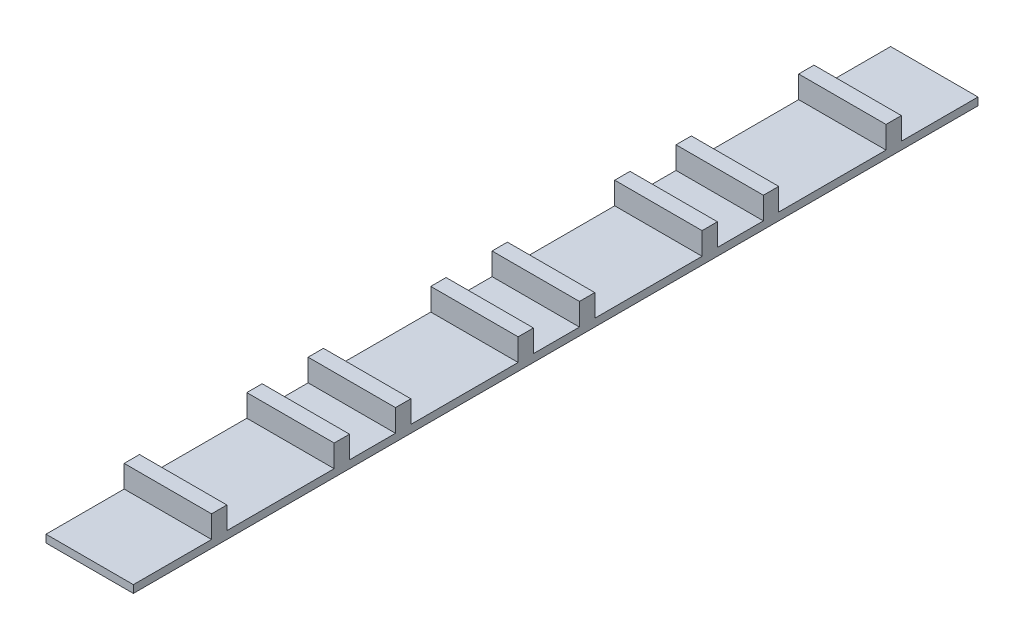
ISO-10303-21;
HEADER;
FILE_DESCRIPTION(('STEP AP214'),'2;1');
FILE_NAME('part.step','',(''),(''),'','','');
FILE_SCHEMA(('AUTOMOTIVE_DESIGN { 1 0 10303 214 1 1 1 1 }'));
ENDSEC;
DATA;
#1=APPLICATION_CONTEXT('core data for automotive mechanical design processes');
#2=APPLICATION_PROTOCOL_DEFINITION('international standard','automotive_design',2000,#1);
#3=PRODUCT_CONTEXT('',#1,'mechanical');
#4=PRODUCT('Part','Part','',(#3));
#5=PRODUCT_RELATED_PRODUCT_CATEGORY('part','',(#4));
#6=PRODUCT_DEFINITION_FORMATION('','',#4);
#7=PRODUCT_DEFINITION_CONTEXT('part definition',#1,'design');
#8=PRODUCT_DEFINITION('design','',#6,#7);
#9=PRODUCT_DEFINITION_SHAPE('','',#8);
#10=(LENGTH_UNIT() NAMED_UNIT(*) SI_UNIT(.MILLI.,.METRE.));
#11=(NAMED_UNIT(*) PLANE_ANGLE_UNIT() SI_UNIT($,.RADIAN.));
#12=(NAMED_UNIT(*) SI_UNIT($,.STERADIAN.) SOLID_ANGLE_UNIT());
#13=UNCERTAINTY_MEASURE_WITH_UNIT(LENGTH_MEASURE(1.E-05),#10,'distance_accuracy_value','');
#14=(GEOMETRIC_REPRESENTATION_CONTEXT(3) GLOBAL_UNCERTAINTY_ASSIGNED_CONTEXT((#13)) GLOBAL_UNIT_ASSIGNED_CONTEXT((#10,
#11,#12)) REPRESENTATION_CONTEXT('',''));
#15=CARTESIAN_POINT('',(0.,0.,0.));
#16=DIRECTION('',(0.,0.,1.));
#17=DIRECTION('',(1.,0.,0.));
#18=AXIS2_PLACEMENT_3D('',#15,#16,#17);
#19=CARTESIAN_POINT('',(0.,1.27,139.954));
#20=DIRECTION('',(0.,-1.,0.));
#21=DIRECTION('',(0.,0.,-1.));
#22=AXIS2_PLACEMENT_3D('',#19,#20,#21);
#23=PLANE('',#22);
#24=DIRECTION('',(1.,0.,0.));
#25=VECTOR('',#24,1.);
#26=CARTESIAN_POINT('',(0.,1.27,127.));
#27=LINE('',#26,#25);
#28=CARTESIAN_POINT('',(0.,1.27,127.));
#29=VERTEX_POINT('',#28);
#30=CARTESIAN_POINT('',(14.478,1.27,127.));
#31=VERTEX_POINT('',#30);
#32=EDGE_CURVE('E65',#29,#31,#27,.T.);
#33=ORIENTED_EDGE('',*,*,#32,.F.);
#34=DIRECTION('',(0.,0.,-1.));
#35=VECTOR('',#34,1.);
#36=CARTESIAN_POINT('',(0.,1.27,139.954));
#37=LINE('',#36,#35);
#38=CARTESIAN_POINT('',(0.,1.27,139.954));
#39=VERTEX_POINT('',#38);
#40=EDGE_CURVE('E302',#39,#29,#37,.T.);
#41=ORIENTED_EDGE('',*,*,#40,.F.);
#42=DIRECTION('',(-1.,0.,0.));
#43=VECTOR('',#42,1.);
#44=CARTESIAN_POINT('',(0.,1.27,139.954));
#45=LINE('',#44,#43);
#46=CARTESIAN_POINT('',(14.478,1.27,139.954));
#47=VERTEX_POINT('',#46);
#48=EDGE_CURVE('E581',#47,#39,#45,.T.);
#49=ORIENTED_EDGE('',*,*,#48,.F.);
#50=DIRECTION('',(0.,0.,-1.));
#51=VECTOR('',#50,1.);
#52=CARTESIAN_POINT('',(14.478,1.27,139.954));
#53=LINE('',#52,#51);
#54=EDGE_CURVE('E600',#47,#31,#53,.T.);
#55=ORIENTED_EDGE('',*,*,#54,.T.);
#56=EDGE_LOOP('',(#33,#41,#49,#55));
#57=FACE_BOUND('',#56,.T.);
#58=ADVANCED_FACE('F41',(#57),#23,.F.);
#59=DIRECTION('',(-1.,0.,0.));
#60=VECTOR('',#59,1.);
#61=CARTESIAN_POINT('',(0.,1.27,124.46));
#62=LINE('',#61,#60);
#63=CARTESIAN_POINT('',(14.478,1.27,124.46));
#64=VERTEX_POINT('',#63);
#65=CARTESIAN_POINT('',(0.,1.27,124.46));
#66=VERTEX_POINT('',#65);
#67=EDGE_CURVE('E298',#64,#66,#62,.T.);
#68=ORIENTED_EDGE('',*,*,#67,.F.);
#69=CARTESIAN_POINT('',(14.478,1.27,106.68));
#70=VERTEX_POINT('',#69);
#71=EDGE_CURVE('E602',#64,#70,#53,.T.);
#72=ORIENTED_EDGE('',*,*,#71,.T.);
#73=DIRECTION('',(1.,0.,0.));
#74=VECTOR('',#73,1.);
#75=CARTESIAN_POINT('',(0.,1.27,106.68));
#76=LINE('',#75,#74);
#77=CARTESIAN_POINT('',(0.,1.27,106.68));
#78=VERTEX_POINT('',#77);
#79=EDGE_CURVE('E304',#78,#70,#76,.T.);
#80=ORIENTED_EDGE('',*,*,#79,.F.);
#81=EDGE_CURVE('E57',#66,#78,#37,.T.);
#82=ORIENTED_EDGE('',*,*,#81,.F.);
#83=EDGE_LOOP('',(#68,#72,#80,#82));
#84=FACE_BOUND('',#83,.T.);
#85=ADVANCED_FACE('F652',(#84),#23,.F.);
#86=DIRECTION('',(-1.,0.,0.));
#87=VECTOR('',#86,1.);
#88=CARTESIAN_POINT('',(0.,1.27,104.14));
#89=LINE('',#88,#87);
#90=CARTESIAN_POINT('',(14.478,1.27,104.14));
#91=VERTEX_POINT('',#90);
#92=CARTESIAN_POINT('',(0.,1.27,104.14));
#93=VERTEX_POINT('',#92);
#94=EDGE_CURVE('E309',#91,#93,#89,.T.);
#95=ORIENTED_EDGE('',*,*,#94,.F.);
#96=CARTESIAN_POINT('',(14.478,1.27,96.52));
#97=VERTEX_POINT('',#96);
#98=EDGE_CURVE('E643',#91,#97,#53,.T.);
#99=ORIENTED_EDGE('',*,*,#98,.T.);
#100=DIRECTION('',(1.,0.,0.));
#101=VECTOR('',#100,1.);
#102=CARTESIAN_POINT('',(0.,1.27,96.52));
#103=LINE('',#102,#101);
#104=CARTESIAN_POINT('',(0.,1.27,96.52));
#105=VERTEX_POINT('',#104);
#106=EDGE_CURVE('E347',#105,#97,#103,.T.);
#107=ORIENTED_EDGE('',*,*,#106,.F.);
#108=EDGE_CURVE('E668',#93,#105,#37,.T.);
#109=ORIENTED_EDGE('',*,*,#108,.F.);
#110=EDGE_LOOP('',(#95,#99,#107,#109));
#111=FACE_BOUND('',#110,.T.);
#112=ADVANCED_FACE('F764',(#111),#23,.F.);
#113=DIRECTION('',(-1.,0.,0.));
#114=VECTOR('',#113,1.);
#115=CARTESIAN_POINT('',(0.,1.27,93.98));
#116=LINE('',#115,#114);
#117=CARTESIAN_POINT('',(14.478,1.27,93.98));
#118=VERTEX_POINT('',#117);
#119=CARTESIAN_POINT('',(0.,1.27,93.98));
#120=VERTEX_POINT('',#119);
#121=EDGE_CURVE('E353',#118,#120,#116,.T.);
#122=ORIENTED_EDGE('',*,*,#121,.F.);
#123=CARTESIAN_POINT('',(14.478,1.27,76.2));
#124=VERTEX_POINT('',#123);
#125=EDGE_CURVE('E638',#118,#124,#53,.T.);
#126=ORIENTED_EDGE('',*,*,#125,.T.);
#127=DIRECTION('',(1.,0.,0.));
#128=VECTOR('',#127,1.);
#129=CARTESIAN_POINT('',(0.,1.27,76.2));
#130=LINE('',#129,#128);
#131=CARTESIAN_POINT('',(0.,1.27,76.2));
#132=VERTEX_POINT('',#131);
#133=EDGE_CURVE('E384',#132,#124,#130,.T.);
#134=ORIENTED_EDGE('',*,*,#133,.F.);
#135=EDGE_CURVE('E670',#120,#132,#37,.T.);
#136=ORIENTED_EDGE('',*,*,#135,.F.);
#137=EDGE_LOOP('',(#122,#126,#134,#136));
#138=FACE_BOUND('',#137,.T.);
#139=ADVANCED_FACE('F752',(#138),#23,.F.);
#140=DIRECTION('',(-1.,0.,0.));
#141=VECTOR('',#140,1.);
#142=CARTESIAN_POINT('',(0.,1.27,73.66));
#143=LINE('',#142,#141);
#144=CARTESIAN_POINT('',(14.478,1.27,73.66));
#145=VERTEX_POINT('',#144);
#146=CARTESIAN_POINT('',(0.,1.27,73.66));
#147=VERTEX_POINT('',#146);
#148=EDGE_CURVE('E390',#145,#147,#143,.T.);
#149=ORIENTED_EDGE('',*,*,#148,.F.);
#150=CARTESIAN_POINT('',(14.478,1.27,66.04));
#151=VERTEX_POINT('',#150);
#152=EDGE_CURVE('E633',#145,#151,#53,.T.);
#153=ORIENTED_EDGE('',*,*,#152,.T.);
#154=DIRECTION('',(1.,0.,0.));
#155=VECTOR('',#154,1.);
#156=CARTESIAN_POINT('',(0.,1.27,66.04));
#157=LINE('',#156,#155);
#158=CARTESIAN_POINT('',(0.,1.27,66.04));
#159=VERTEX_POINT('',#158);
#160=EDGE_CURVE('E421',#159,#151,#157,.T.);
#161=ORIENTED_EDGE('',*,*,#160,.F.);
#162=EDGE_CURVE('E673',#147,#159,#37,.T.);
#163=ORIENTED_EDGE('',*,*,#162,.F.);
#164=EDGE_LOOP('',(#149,#153,#161,#163));
#165=FACE_BOUND('',#164,.T.);
#166=ADVANCED_FACE('F739',(#165),#23,.F.);
#167=DIRECTION('',(-1.,0.,0.));
#168=VECTOR('',#167,1.);
#169=CARTESIAN_POINT('',(0.,1.27,63.5));
#170=LINE('',#169,#168);
#171=CARTESIAN_POINT('',(14.478,1.27,63.5));
#172=VERTEX_POINT('',#171);
#173=CARTESIAN_POINT('',(0.,1.27,63.5));
#174=VERTEX_POINT('',#173);
#175=EDGE_CURVE('E427',#172,#174,#170,.T.);
#176=ORIENTED_EDGE('',*,*,#175,.F.);
#177=CARTESIAN_POINT('',(14.478,1.27,45.72));
#178=VERTEX_POINT('',#177);
#179=EDGE_CURVE('E628',#172,#178,#53,.T.);
#180=ORIENTED_EDGE('',*,*,#179,.T.);
#181=DIRECTION('',(1.,0.,0.));
#182=VECTOR('',#181,1.);
#183=CARTESIAN_POINT('',(0.,1.27,45.72));
#184=LINE('',#183,#182);
#185=CARTESIAN_POINT('',(0.,1.27,45.72));
#186=VERTEX_POINT('',#185);
#187=EDGE_CURVE('E458',#186,#178,#184,.T.);
#188=ORIENTED_EDGE('',*,*,#187,.F.);
#189=EDGE_CURVE('E676',#174,#186,#37,.T.);
#190=ORIENTED_EDGE('',*,*,#189,.F.);
#191=EDGE_LOOP('',(#176,#180,#188,#190));
#192=FACE_BOUND('',#191,.T.);
#193=ADVANCED_FACE('F726',(#192),#23,.F.);
#194=DIRECTION('',(-1.,0.,0.));
#195=VECTOR('',#194,1.);
#196=CARTESIAN_POINT('',(0.,1.27,43.18));
#197=LINE('',#196,#195);
#198=CARTESIAN_POINT('',(14.478,1.27,43.18));
#199=VERTEX_POINT('',#198);
#200=CARTESIAN_POINT('',(0.,1.27,43.18));
#201=VERTEX_POINT('',#200);
#202=EDGE_CURVE('E464',#199,#201,#197,.T.);
#203=ORIENTED_EDGE('',*,*,#202,.F.);
#204=CARTESIAN_POINT('',(14.478,1.27,35.56));
#205=VERTEX_POINT('',#204);
#206=EDGE_CURVE('E623',#199,#205,#53,.T.);
#207=ORIENTED_EDGE('',*,*,#206,.T.);
#208=DIRECTION('',(1.,0.,0.));
#209=VECTOR('',#208,1.);
#210=CARTESIAN_POINT('',(0.,1.27,35.56));
#211=LINE('',#210,#209);
#212=CARTESIAN_POINT('',(0.,1.27,35.56));
#213=VERTEX_POINT('',#212);
#214=EDGE_CURVE('E495',#213,#205,#211,.T.);
#215=ORIENTED_EDGE('',*,*,#214,.F.);
#216=EDGE_CURVE('E679',#201,#213,#37,.T.);
#217=ORIENTED_EDGE('',*,*,#216,.F.);
#218=EDGE_LOOP('',(#203,#207,#215,#217));
#219=FACE_BOUND('',#218,.T.);
#220=ADVANCED_FACE('F713',(#219),#23,.F.);
#221=DIRECTION('',(-1.,0.,0.));
#222=VECTOR('',#221,1.);
#223=CARTESIAN_POINT('',(0.,1.27,33.02));
#224=LINE('',#223,#222);
#225=CARTESIAN_POINT('',(14.478,1.27,33.02));
#226=VERTEX_POINT('',#225);
#227=CARTESIAN_POINT('',(0.,1.27,33.02));
#228=VERTEX_POINT('',#227);
#229=EDGE_CURVE('E501',#226,#228,#224,.T.);
#230=ORIENTED_EDGE('',*,*,#229,.F.);
#231=CARTESIAN_POINT('',(14.478,1.27,15.24));
#232=VERTEX_POINT('',#231);
#233=EDGE_CURVE('E621',#226,#232,#53,.T.);
#234=ORIENTED_EDGE('',*,*,#233,.T.);
#235=DIRECTION('',(1.,0.,0.));
#236=VECTOR('',#235,1.);
#237=CARTESIAN_POINT('',(0.,1.27,15.24));
#238=LINE('',#237,#236);
#239=CARTESIAN_POINT('',(0.,1.27,15.24));
#240=VERTEX_POINT('',#239);
#241=EDGE_CURVE('E532',#240,#232,#238,.T.);
#242=ORIENTED_EDGE('',*,*,#241,.F.);
#243=EDGE_CURVE('E682',#228,#240,#37,.T.);
#244=ORIENTED_EDGE('',*,*,#243,.F.);
#245=EDGE_LOOP('',(#230,#234,#242,#244));
#246=FACE_BOUND('',#245,.T.);
#247=ADVANCED_FACE('F699',(#246),#23,.F.);
#248=DIRECTION('',(-1.,0.,0.));
#249=VECTOR('',#248,1.);
#250=CARTESIAN_POINT('',(0.,1.27,12.7));
#251=LINE('',#250,#249);
#252=CARTESIAN_POINT('',(14.478,1.27,12.7));
#253=VERTEX_POINT('',#252);
#254=CARTESIAN_POINT('',(0.,1.27,12.7));
#255=VERTEX_POINT('',#254);
#256=EDGE_CURVE('E538',#253,#255,#251,.T.);
#257=ORIENTED_EDGE('',*,*,#256,.F.);
#258=CARTESIAN_POINT('',(14.478,1.27,0.));
#259=VERTEX_POINT('',#258);
#260=EDGE_CURVE('E599',#253,#259,#53,.T.);
#261=ORIENTED_EDGE('',*,*,#260,.T.);
#262=DIRECTION('',(-1.,0.,0.));
#263=VECTOR('',#262,1.);
#264=CARTESIAN_POINT('',(0.,1.27,0.));
#265=LINE('',#264,#263);
#266=CARTESIAN_POINT('',(0.,1.27,0.));
#267=VERTEX_POINT('',#266);
#268=EDGE_CURVE('E575',#259,#267,#265,.T.);
#269=ORIENTED_EDGE('',*,*,#268,.T.);
#270=EDGE_CURVE('E584',#255,#267,#37,.T.);
#271=ORIENTED_EDGE('',*,*,#270,.F.);
#272=EDGE_LOOP('',(#257,#261,#269,#271));
#273=FACE_BOUND('',#272,.T.);
#274=ADVANCED_FACE('F618',(#273),#23,.F.);
#275=CARTESIAN_POINT('',(0.,0.,139.954));
#276=DIRECTION('',(1.,0.,0.));
#277=DIRECTION('',(0.,0.,-1.));
#278=AXIS2_PLACEMENT_3D('',#275,#276,#277);
#279=PLANE('',#278);
#280=DIRECTION('',(0.,-1.,0.));
#281=VECTOR('',#280,1.);
#282=CARTESIAN_POINT('',(0.,0.,0.));
#283=LINE('',#282,#281);
#284=CARTESIAN_POINT('',(0.,0.,0.));
#285=VERTEX_POINT('',#284);
#286=EDGE_CURVE('E569',#267,#285,#283,.T.);
#287=ORIENTED_EDGE('',*,*,#286,.T.);
#288=DIRECTION('',(0.,0.,-1.));
#289=VECTOR('',#288,1.);
#290=CARTESIAN_POINT('',(0.,0.,139.954));
#291=LINE('',#290,#289);
#292=CARTESIAN_POINT('',(0.,0.,139.954));
#293=VERTEX_POINT('',#292);
#294=EDGE_CURVE('E11',#293,#285,#291,.T.);
#295=ORIENTED_EDGE('',*,*,#294,.F.);
#296=DIRECTION('',(0.,-1.,0.));
#297=VECTOR('',#296,1.);
#298=CARTESIAN_POINT('',(0.,0.,139.954));
#299=LINE('',#298,#297);
#300=EDGE_CURVE('E570',#39,#293,#299,.T.);
#301=ORIENTED_EDGE('',*,*,#300,.F.);
#302=ORIENTED_EDGE('',*,*,#40,.T.);
#303=DIRECTION('',(0.,-1.,0.));
#304=VECTOR('',#303,1.);
#305=CARTESIAN_POINT('',(0.,4.953,127.));
#306=LINE('',#305,#304);
#307=CARTESIAN_POINT('',(0.,4.953,127.));
#308=VERTEX_POINT('',#307);
#309=EDGE_CURVE('E281',#308,#29,#306,.T.);
#310=ORIENTED_EDGE('',*,*,#309,.F.);
#311=DIRECTION('',(0.,0.,1.));
#312=VECTOR('',#311,1.);
#313=CARTESIAN_POINT('',(0.,4.953,124.46));
#314=LINE('',#313,#312);
#315=CARTESIAN_POINT('',(0.,4.953,124.46));
#316=VERTEX_POINT('',#315);
#317=EDGE_CURVE('E288',#316,#308,#314,.T.);
#318=ORIENTED_EDGE('',*,*,#317,.F.);
#319=DIRECTION('',(0.,-1.,0.));
#320=VECTOR('',#319,1.);
#321=CARTESIAN_POINT('',(0.,4.953,124.46));
#322=LINE('',#321,#320);
#323=EDGE_CURVE('E666',#316,#66,#322,.T.);
#324=ORIENTED_EDGE('',*,*,#323,.T.);
#325=ORIENTED_EDGE('',*,*,#81,.T.);
#326=DIRECTION('',(0.,-1.,0.));
#327=VECTOR('',#326,1.);
#328=CARTESIAN_POINT('',(0.,4.953,106.68));
#329=LINE('',#328,#327);
#330=CARTESIAN_POINT('',(0.,4.953,106.68));
#331=VERTEX_POINT('',#330);
#332=EDGE_CURVE('E343',#331,#78,#329,.T.);
#333=ORIENTED_EDGE('',*,*,#332,.F.);
#334=DIRECTION('',(0.,0.,1.));
#335=VECTOR('',#334,1.);
#336=CARTESIAN_POINT('',(0.,4.953,104.14));
#337=LINE('',#336,#335);
#338=CARTESIAN_POINT('',(0.,4.953,104.14));
#339=VERTEX_POINT('',#338);
#340=EDGE_CURVE('E315',#339,#331,#337,.T.);
#341=ORIENTED_EDGE('',*,*,#340,.F.);
#342=DIRECTION('',(0.,-1.,0.));
#343=VECTOR('',#342,1.);
#344=CARTESIAN_POINT('',(0.,4.953,104.14));
#345=LINE('',#344,#343);
#346=EDGE_CURVE('E327',#339,#93,#345,.T.);
#347=ORIENTED_EDGE('',*,*,#346,.T.);
#348=ORIENTED_EDGE('',*,*,#108,.T.);
#349=DIRECTION('',(0.,-1.,0.));
#350=VECTOR('',#349,1.);
#351=CARTESIAN_POINT('',(0.,4.953,96.52));
#352=LINE('',#351,#350);
#353=CARTESIAN_POINT('',(0.,4.953,96.52));
#354=VERTEX_POINT('',#353);
#355=EDGE_CURVE('E380',#354,#105,#352,.T.);
#356=ORIENTED_EDGE('',*,*,#355,.F.);
#357=DIRECTION('',(0.,0.,1.));
#358=VECTOR('',#357,1.);
#359=CARTESIAN_POINT('',(0.,4.953,93.98));
#360=LINE('',#359,#358);
#361=CARTESIAN_POINT('',(0.,4.953,93.98));
#362=VERTEX_POINT('',#361);
#363=EDGE_CURVE('E348',#362,#354,#360,.T.);
#364=ORIENTED_EDGE('',*,*,#363,.F.);
#365=DIRECTION('',(0.,-1.,0.));
#366=VECTOR('',#365,1.);
#367=CARTESIAN_POINT('',(0.,4.953,93.98));
#368=LINE('',#367,#366);
#369=EDGE_CURVE('E362',#362,#120,#368,.T.);
#370=ORIENTED_EDGE('',*,*,#369,.T.);
#371=ORIENTED_EDGE('',*,*,#135,.T.);
#372=DIRECTION('',(0.,-1.,0.));
#373=VECTOR('',#372,1.);
#374=CARTESIAN_POINT('',(0.,4.953,76.2));
#375=LINE('',#374,#373);
#376=CARTESIAN_POINT('',(0.,4.953,76.2));
#377=VERTEX_POINT('',#376);
#378=EDGE_CURVE('E417',#377,#132,#375,.T.);
#379=ORIENTED_EDGE('',*,*,#378,.F.);
#380=DIRECTION('',(0.,0.,1.));
#381=VECTOR('',#380,1.);
#382=CARTESIAN_POINT('',(0.,4.953,73.66));
#383=LINE('',#382,#381);
#384=CARTESIAN_POINT('',(0.,4.953,73.66));
#385=VERTEX_POINT('',#384);
#386=EDGE_CURVE('E385',#385,#377,#383,.T.);
#387=ORIENTED_EDGE('',*,*,#386,.F.);
#388=DIRECTION('',(0.,-1.,0.));
#389=VECTOR('',#388,1.);
#390=CARTESIAN_POINT('',(0.,4.953,73.66));
#391=LINE('',#390,#389);
#392=EDGE_CURVE('E399',#385,#147,#391,.T.);
#393=ORIENTED_EDGE('',*,*,#392,.T.);
#394=ORIENTED_EDGE('',*,*,#162,.T.);
#395=DIRECTION('',(0.,-1.,0.));
#396=VECTOR('',#395,1.);
#397=CARTESIAN_POINT('',(0.,4.953,66.04));
#398=LINE('',#397,#396);
#399=CARTESIAN_POINT('',(0.,4.953,66.04));
#400=VERTEX_POINT('',#399);
#401=EDGE_CURVE('E454',#400,#159,#398,.T.);
#402=ORIENTED_EDGE('',*,*,#401,.F.);
#403=DIRECTION('',(0.,0.,1.));
#404=VECTOR('',#403,1.);
#405=CARTESIAN_POINT('',(0.,4.953,63.5));
#406=LINE('',#405,#404);
#407=CARTESIAN_POINT('',(0.,4.953,63.5));
#408=VERTEX_POINT('',#407);
#409=EDGE_CURVE('E422',#408,#400,#406,.T.);
#410=ORIENTED_EDGE('',*,*,#409,.F.);
#411=DIRECTION('',(0.,-1.,0.));
#412=VECTOR('',#411,1.);
#413=CARTESIAN_POINT('',(0.,4.953,63.5));
#414=LINE('',#413,#412);
#415=EDGE_CURVE('E436',#408,#174,#414,.T.);
#416=ORIENTED_EDGE('',*,*,#415,.T.);
#417=ORIENTED_EDGE('',*,*,#189,.T.);
#418=DIRECTION('',(0.,-1.,0.));
#419=VECTOR('',#418,1.);
#420=CARTESIAN_POINT('',(0.,4.953,45.72));
#421=LINE('',#420,#419);
#422=CARTESIAN_POINT('',(0.,4.953,45.72));
#423=VERTEX_POINT('',#422);
#424=EDGE_CURVE('E491',#423,#186,#421,.T.);
#425=ORIENTED_EDGE('',*,*,#424,.F.);
#426=DIRECTION('',(0.,0.,1.));
#427=VECTOR('',#426,1.);
#428=CARTESIAN_POINT('',(0.,4.953,43.18));
#429=LINE('',#428,#427);
#430=CARTESIAN_POINT('',(0.,4.953,43.18));
#431=VERTEX_POINT('',#430);
#432=EDGE_CURVE('E459',#431,#423,#429,.T.);
#433=ORIENTED_EDGE('',*,*,#432,.F.);
#434=DIRECTION('',(0.,-1.,0.));
#435=VECTOR('',#434,1.);
#436=CARTESIAN_POINT('',(0.,4.953,43.18));
#437=LINE('',#436,#435);
#438=EDGE_CURVE('E473',#431,#201,#437,.T.);
#439=ORIENTED_EDGE('',*,*,#438,.T.);
#440=ORIENTED_EDGE('',*,*,#216,.T.);
#441=DIRECTION('',(0.,-1.,0.));
#442=VECTOR('',#441,1.);
#443=CARTESIAN_POINT('',(0.,4.953,35.56));
#444=LINE('',#443,#442);
#445=CARTESIAN_POINT('',(0.,4.953,35.56));
#446=VERTEX_POINT('',#445);
#447=EDGE_CURVE('E528',#446,#213,#444,.T.);
#448=ORIENTED_EDGE('',*,*,#447,.F.);
#449=DIRECTION('',(0.,0.,1.));
#450=VECTOR('',#449,1.);
#451=CARTESIAN_POINT('',(0.,4.953,33.02));
#452=LINE('',#451,#450);
#453=CARTESIAN_POINT('',(0.,4.953,33.02));
#454=VERTEX_POINT('',#453);
#455=EDGE_CURVE('E496',#454,#446,#452,.T.);
#456=ORIENTED_EDGE('',*,*,#455,.F.);
#457=DIRECTION('',(0.,-1.,0.));
#458=VECTOR('',#457,1.);
#459=CARTESIAN_POINT('',(0.,4.953,33.02));
#460=LINE('',#459,#458);
#461=EDGE_CURVE('E510',#454,#228,#460,.T.);
#462=ORIENTED_EDGE('',*,*,#461,.T.);
#463=ORIENTED_EDGE('',*,*,#243,.T.);
#464=DIRECTION('',(0.,-1.,0.));
#465=VECTOR('',#464,1.);
#466=CARTESIAN_POINT('',(0.,4.953,15.24));
#467=LINE('',#466,#465);
#468=CARTESIAN_POINT('',(0.,4.953,15.24));
#469=VERTEX_POINT('',#468);
#470=EDGE_CURVE('E565',#469,#240,#467,.T.);
#471=ORIENTED_EDGE('',*,*,#470,.F.);
#472=DIRECTION('',(0.,0.,1.));
#473=VECTOR('',#472,1.);
#474=CARTESIAN_POINT('',(0.,4.953,12.7));
#475=LINE('',#474,#473);
#476=CARTESIAN_POINT('',(0.,4.953,12.7));
#477=VERTEX_POINT('',#476);
#478=EDGE_CURVE('E533',#477,#469,#475,.T.);
#479=ORIENTED_EDGE('',*,*,#478,.F.);
#480=DIRECTION('',(0.,-1.,0.));
#481=VECTOR('',#480,1.);
#482=CARTESIAN_POINT('',(0.,4.953,12.7));
#483=LINE('',#482,#481);
#484=EDGE_CURVE('E547',#477,#255,#483,.T.);
#485=ORIENTED_EDGE('',*,*,#484,.T.);
#486=ORIENTED_EDGE('',*,*,#270,.T.);
#487=EDGE_LOOP('',(#287,#295,#301,#302,#310,#318,#324,#325,#333,#341,#347,#348,#356,#364,#370,
#371,#379,#387,#393,#394,#402,#410,#416,#417,#425,#433,#439,#440,#448,#456,#462,#463,#471,#479,
#485,#486));
#488=FACE_BOUND('',#487,.T.);
#489=ADVANCED_FACE('F43',(#488),#279,.F.);
#490=CARTESIAN_POINT('',(0.,0.,139.954));
#491=DIRECTION('',(0.,1.,0.));
#492=DIRECTION('',(0.,0.,1.));
#493=AXIS2_PLACEMENT_3D('',#490,#491,#492);
#494=PLANE('',#493);
#495=DIRECTION('',(1.,0.,0.));
#496=VECTOR('',#495,1.);
#497=CARTESIAN_POINT('',(0.,0.,0.));
#498=LINE('',#497,#496);
#499=CARTESIAN_POINT('',(14.478,0.,0.));
#500=VERTEX_POINT('',#499);
#501=EDGE_CURVE('E587',#285,#500,#498,.T.);
#502=ORIENTED_EDGE('',*,*,#501,.T.);
#503=DIRECTION('',(0.,0.,-1.));
#504=VECTOR('',#503,1.);
#505=CARTESIAN_POINT('',(14.478,0.,139.954));
#506=LINE('',#505,#504);
#507=CARTESIAN_POINT('',(14.478,0.,139.954));
#508=VERTEX_POINT('',#507);
#509=EDGE_CURVE('E50',#508,#500,#506,.T.);
#510=ORIENTED_EDGE('',*,*,#509,.F.);
#511=DIRECTION('',(1.,0.,0.));
#512=VECTOR('',#511,1.);
#513=CARTESIAN_POINT('',(0.,0.,139.954));
#514=LINE('',#513,#512);
#515=EDGE_CURVE('E574',#293,#508,#514,.T.);
#516=ORIENTED_EDGE('',*,*,#515,.F.);
#517=ORIENTED_EDGE('',*,*,#294,.T.);
#518=EDGE_LOOP('',(#502,#510,#516,#517));
#519=FACE_BOUND('',#518,.T.);
#520=ADVANCED_FACE('F787',(#519),#494,.F.);
#521=CARTESIAN_POINT('',(14.478,0.,139.954));
#522=DIRECTION('',(-1.,0.,0.));
#523=DIRECTION('',(0.,0.,1.));
#524=AXIS2_PLACEMENT_3D('',#521,#522,#523);
#525=PLANE('',#524);
#526=DIRECTION('',(0.,1.,0.));
#527=VECTOR('',#526,1.);
#528=CARTESIAN_POINT('',(14.478,0.,0.));
#529=LINE('',#528,#527);
#530=EDGE_CURVE('E590',#500,#259,#529,.T.);
#531=ORIENTED_EDGE('',*,*,#530,.T.);
#532=ORIENTED_EDGE('',*,*,#260,.F.);
#533=DIRECTION('',(0.,-1.,0.));
#534=VECTOR('',#533,1.);
#535=CARTESIAN_POINT('',(14.478,4.953,12.7));
#536=LINE('',#535,#534);
#537=CARTESIAN_POINT('',(14.478,4.953,12.7));
#538=VERTEX_POINT('',#537);
#539=EDGE_CURVE('E557',#538,#253,#536,.T.);
#540=ORIENTED_EDGE('',*,*,#539,.F.);
#541=DIRECTION('',(0.,0.,-1.));
#542=VECTOR('',#541,1.);
#543=CARTESIAN_POINT('',(14.478,4.953,12.7));
#544=LINE('',#543,#542);
#545=CARTESIAN_POINT('',(14.478,4.953,15.24));
#546=VERTEX_POINT('',#545);
#547=EDGE_CURVE('E541',#546,#538,#544,.T.);
#548=ORIENTED_EDGE('',*,*,#547,.F.);
#549=DIRECTION('',(0.,-1.,0.));
#550=VECTOR('',#549,1.);
#551=CARTESIAN_POINT('',(14.478,4.953,15.24));
#552=LINE('',#551,#550);
#553=EDGE_CURVE('E561',#546,#232,#552,.T.);
#554=ORIENTED_EDGE('',*,*,#553,.T.);
#555=ORIENTED_EDGE('',*,*,#233,.F.);
#556=DIRECTION('',(0.,-1.,0.));
#557=VECTOR('',#556,1.);
#558=CARTESIAN_POINT('',(14.478,4.953,33.02));
#559=LINE('',#558,#557);
#560=CARTESIAN_POINT('',(14.478,4.953,33.02));
#561=VERTEX_POINT('',#560);
#562=EDGE_CURVE('E520',#561,#226,#559,.T.);
#563=ORIENTED_EDGE('',*,*,#562,.F.);
#564=DIRECTION('',(0.,0.,-1.));
#565=VECTOR('',#564,1.);
#566=CARTESIAN_POINT('',(14.478,4.953,33.02));
#567=LINE('',#566,#565);
#568=CARTESIAN_POINT('',(14.478,4.953,35.56));
#569=VERTEX_POINT('',#568);
#570=EDGE_CURVE('E504',#569,#561,#567,.T.);
#571=ORIENTED_EDGE('',*,*,#570,.F.);
#572=DIRECTION('',(0.,-1.,0.));
#573=VECTOR('',#572,1.);
#574=CARTESIAN_POINT('',(14.478,4.953,35.56));
#575=LINE('',#574,#573);
#576=EDGE_CURVE('E524',#569,#205,#575,.T.);
#577=ORIENTED_EDGE('',*,*,#576,.T.);
#578=ORIENTED_EDGE('',*,*,#206,.F.);
#579=DIRECTION('',(0.,-1.,0.));
#580=VECTOR('',#579,1.);
#581=CARTESIAN_POINT('',(14.478,4.953,43.18));
#582=LINE('',#581,#580);
#583=CARTESIAN_POINT('',(14.478,4.953,43.18));
#584=VERTEX_POINT('',#583);
#585=EDGE_CURVE('E483',#584,#199,#582,.T.);
#586=ORIENTED_EDGE('',*,*,#585,.F.);
#587=DIRECTION('',(0.,0.,-1.));
#588=VECTOR('',#587,1.);
#589=CARTESIAN_POINT('',(14.478,4.953,43.18));
#590=LINE('',#589,#588);
#591=CARTESIAN_POINT('',(14.478,4.953,45.72));
#592=VERTEX_POINT('',#591);
#593=EDGE_CURVE('E467',#592,#584,#590,.T.);
#594=ORIENTED_EDGE('',*,*,#593,.F.);
#595=DIRECTION('',(0.,-1.,0.));
#596=VECTOR('',#595,1.);
#597=CARTESIAN_POINT('',(14.478,4.953,45.72));
#598=LINE('',#597,#596);
#599=EDGE_CURVE('E487',#592,#178,#598,.T.);
#600=ORIENTED_EDGE('',*,*,#599,.T.);
#601=ORIENTED_EDGE('',*,*,#179,.F.);
#602=DIRECTION('',(0.,-1.,0.));
#603=VECTOR('',#602,1.);
#604=CARTESIAN_POINT('',(14.478,4.953,63.5));
#605=LINE('',#604,#603);
#606=CARTESIAN_POINT('',(14.478,4.953,63.5));
#607=VERTEX_POINT('',#606);
#608=EDGE_CURVE('E446',#607,#172,#605,.T.);
#609=ORIENTED_EDGE('',*,*,#608,.F.);
#610=DIRECTION('',(0.,0.,-1.));
#611=VECTOR('',#610,1.);
#612=CARTESIAN_POINT('',(14.478,4.953,63.5));
#613=LINE('',#612,#611);
#614=CARTESIAN_POINT('',(14.478,4.953,66.04));
#615=VERTEX_POINT('',#614);
#616=EDGE_CURVE('E430',#615,#607,#613,.T.);
#617=ORIENTED_EDGE('',*,*,#616,.F.);
#618=DIRECTION('',(0.,-1.,0.));
#619=VECTOR('',#618,1.);
#620=CARTESIAN_POINT('',(14.478,4.953,66.04));
#621=LINE('',#620,#619);
#622=EDGE_CURVE('E450',#615,#151,#621,.T.);
#623=ORIENTED_EDGE('',*,*,#622,.T.);
#624=ORIENTED_EDGE('',*,*,#152,.F.);
#625=DIRECTION('',(0.,-1.,0.));
#626=VECTOR('',#625,1.);
#627=CARTESIAN_POINT('',(14.478,4.953,73.66));
#628=LINE('',#627,#626);
#629=CARTESIAN_POINT('',(14.478,4.953,73.66));
#630=VERTEX_POINT('',#629);
#631=EDGE_CURVE('E409',#630,#145,#628,.T.);
#632=ORIENTED_EDGE('',*,*,#631,.F.);
#633=DIRECTION('',(0.,0.,-1.));
#634=VECTOR('',#633,1.);
#635=CARTESIAN_POINT('',(14.478,4.953,73.66));
#636=LINE('',#635,#634);
#637=CARTESIAN_POINT('',(14.478,4.953,76.2));
#638=VERTEX_POINT('',#637);
#639=EDGE_CURVE('E393',#638,#630,#636,.T.);
#640=ORIENTED_EDGE('',*,*,#639,.F.);
#641=DIRECTION('',(0.,-1.,0.));
#642=VECTOR('',#641,1.);
#643=CARTESIAN_POINT('',(14.478,4.953,76.2));
#644=LINE('',#643,#642);
#645=EDGE_CURVE('E413',#638,#124,#644,.T.);
#646=ORIENTED_EDGE('',*,*,#645,.T.);
#647=ORIENTED_EDGE('',*,*,#125,.F.);
#648=DIRECTION('',(0.,-1.,0.));
#649=VECTOR('',#648,1.);
#650=CARTESIAN_POINT('',(14.478,4.953,93.98));
#651=LINE('',#650,#649);
#652=CARTESIAN_POINT('',(14.478,4.953,93.98));
#653=VERTEX_POINT('',#652);
#654=EDGE_CURVE('E372',#653,#118,#651,.T.);
#655=ORIENTED_EDGE('',*,*,#654,.F.);
#656=DIRECTION('',(0.,0.,-1.));
#657=VECTOR('',#656,1.);
#658=CARTESIAN_POINT('',(14.478,4.953,93.98));
#659=LINE('',#658,#657);
#660=CARTESIAN_POINT('',(14.478,4.953,96.52));
#661=VERTEX_POINT('',#660);
#662=EDGE_CURVE('E356',#661,#653,#659,.T.);
#663=ORIENTED_EDGE('',*,*,#662,.F.);
#664=DIRECTION('',(0.,-1.,0.));
#665=VECTOR('',#664,1.);
#666=CARTESIAN_POINT('',(14.478,4.953,96.52));
#667=LINE('',#666,#665);
#668=EDGE_CURVE('E376',#661,#97,#667,.T.);
#669=ORIENTED_EDGE('',*,*,#668,.T.);
#670=ORIENTED_EDGE('',*,*,#98,.F.);
#671=DIRECTION('',(0.,-1.,0.));
#672=VECTOR('',#671,1.);
#673=CARTESIAN_POINT('',(14.478,4.953,104.14));
#674=LINE('',#673,#672);
#675=CARTESIAN_POINT('',(14.478,4.953,104.14));
#676=VERTEX_POINT('',#675);
#677=EDGE_CURVE('E335',#676,#91,#674,.T.);
#678=ORIENTED_EDGE('',*,*,#677,.F.);
#679=DIRECTION('',(0.,0.,-1.));
#680=VECTOR('',#679,1.);
#681=CARTESIAN_POINT('',(14.478,4.953,104.14));
#682=LINE('',#681,#680);
#683=CARTESIAN_POINT('',(14.478,4.953,106.68));
#684=VERTEX_POINT('',#683);
#685=EDGE_CURVE('E322',#684,#676,#682,.T.);
#686=ORIENTED_EDGE('',*,*,#685,.F.);
#687=DIRECTION('',(0.,-1.,0.));
#688=VECTOR('',#687,1.);
#689=CARTESIAN_POINT('',(14.478,4.953,106.68));
#690=LINE('',#689,#688);
#691=EDGE_CURVE('E339',#684,#70,#690,.T.);
#692=ORIENTED_EDGE('',*,*,#691,.T.);
#693=ORIENTED_EDGE('',*,*,#71,.F.);
#694=DIRECTION('',(0.,-1.,0.));
#695=VECTOR('',#694,1.);
#696=CARTESIAN_POINT('',(14.478,4.953,124.46));
#697=LINE('',#696,#695);
#698=CARTESIAN_POINT('',(14.478,4.953,124.46));
#699=VERTEX_POINT('',#698);
#700=EDGE_CURVE('E311',#699,#64,#697,.T.);
#701=ORIENTED_EDGE('',*,*,#700,.F.);
#702=DIRECTION('',(0.,0.,-1.));
#703=VECTOR('',#702,1.);
#704=CARTESIAN_POINT('',(14.478,4.953,124.46));
#705=LINE('',#704,#703);
#706=CARTESIAN_POINT('',(14.478,4.953,127.));
#707=VERTEX_POINT('',#706);
#708=EDGE_CURVE('E287',#707,#699,#705,.T.);
#709=ORIENTED_EDGE('',*,*,#708,.F.);
#710=DIRECTION('',(0.,-1.,0.));
#711=VECTOR('',#710,1.);
#712=CARTESIAN_POINT('',(14.478,4.953,127.));
#713=LINE('',#712,#711);
#714=EDGE_CURVE('E283',#707,#31,#713,.T.);
#715=ORIENTED_EDGE('',*,*,#714,.T.);
#716=ORIENTED_EDGE('',*,*,#54,.F.);
#717=DIRECTION('',(0.,1.,0.));
#718=VECTOR('',#717,1.);
#719=CARTESIAN_POINT('',(14.478,0.,139.954));
#720=LINE('',#719,#718);
#721=EDGE_CURVE('E578',#508,#47,#720,.T.);
#722=ORIENTED_EDGE('',*,*,#721,.F.);
#723=ORIENTED_EDGE('',*,*,#509,.T.);
#724=EDGE_LOOP('',(#531,#532,#540,#548,#554,#555,#563,#571,#577,#578,#586,#594,#600,#601,#609,
#617,#623,#624,#632,#640,#646,#647,#655,#663,#669,#670,#678,#686,#692,#693,#701,#709,#715,#716,
#722,#723));
#725=FACE_BOUND('',#724,.T.);
#726=ADVANCED_FACE('F609',(#725),#525,.F.);
#727=CARTESIAN_POINT('',(0.,0.,139.954));
#728=DIRECTION('',(0.,0.,-1.));
#729=DIRECTION('',(-1.,0.,0.));
#730=AXIS2_PLACEMENT_3D('',#727,#728,#729);
#731=PLANE('',#730);
#732=ORIENTED_EDGE('',*,*,#300,.T.);
#733=ORIENTED_EDGE('',*,*,#515,.T.);
#734=ORIENTED_EDGE('',*,*,#721,.T.);
#735=ORIENTED_EDGE('',*,*,#48,.T.);
#736=EDGE_LOOP('',(#732,#733,#734,#735));
#737=FACE_BOUND('',#736,.T.);
#738=ADVANCED_FACE('F881',(#737),#731,.F.);
#739=CARTESIAN_POINT('',(0.,0.,0.));
#740=DIRECTION('',(0.,0.,-1.));
#741=DIRECTION('',(-1.,0.,0.));
#742=AXIS2_PLACEMENT_3D('',#739,#740,#741);
#743=PLANE('',#742);
#744=ORIENTED_EDGE('',*,*,#286,.F.);
#745=ORIENTED_EDGE('',*,*,#268,.F.);
#746=ORIENTED_EDGE('',*,*,#530,.F.);
#747=ORIENTED_EDGE('',*,*,#501,.F.);
#748=EDGE_LOOP('',(#744,#745,#746,#747));
#749=FACE_BOUND('',#748,.T.);
#750=ADVANCED_FACE('F616',(#749),#743,.T.);
#751=CARTESIAN_POINT('',(0.,4.953,15.24));
#752=DIRECTION('',(0.,0.,-1.));
#753=DIRECTION('',(-1.,0.,0.));
#754=AXIS2_PLACEMENT_3D('',#751,#752,#753);
#755=PLANE('',#754);
#756=ORIENTED_EDGE('',*,*,#241,.T.);
#757=ORIENTED_EDGE('',*,*,#553,.F.);
#758=DIRECTION('',(1.,0.,0.));
#759=VECTOR('',#758,1.);
#760=CARTESIAN_POINT('',(0.,4.953,15.24));
#761=LINE('',#760,#759);
#762=EDGE_CURVE('E537',#469,#546,#761,.T.);
#763=ORIENTED_EDGE('',*,*,#762,.F.);
#764=ORIENTED_EDGE('',*,*,#470,.T.);
#765=EDGE_LOOP('',(#756,#757,#763,#764));
#766=FACE_BOUND('',#765,.T.);
#767=ADVANCED_FACE('F698',(#766),#755,.F.);
#768=CARTESIAN_POINT('',(0.,4.953,12.7));
#769=DIRECTION('',(0.,0.,1.));
#770=DIRECTION('',(1.,0.,0.));
#771=AXIS2_PLACEMENT_3D('',#768,#769,#770);
#772=PLANE('',#771);
#773=ORIENTED_EDGE('',*,*,#256,.T.);
#774=ORIENTED_EDGE('',*,*,#484,.F.);
#775=DIRECTION('',(-1.,0.,0.));
#776=VECTOR('',#775,1.);
#777=CARTESIAN_POINT('',(0.,4.953,12.7));
#778=LINE('',#777,#776);
#779=EDGE_CURVE('E544',#538,#477,#778,.T.);
#780=ORIENTED_EDGE('',*,*,#779,.F.);
#781=ORIENTED_EDGE('',*,*,#539,.T.);
#782=EDGE_LOOP('',(#773,#774,#780,#781));
#783=FACE_BOUND('',#782,.T.);
#784=ADVANCED_FACE('F692',(#783),#772,.F.);
#785=CARTESIAN_POINT('',(0.,4.953,0.));
#786=DIRECTION('',(0.,1.,0.));
#787=DIRECTION('',(0.,0.,1.));
#788=AXIS2_PLACEMENT_3D('',#785,#786,#787);
#789=PLANE('',#788);
#790=ORIENTED_EDGE('',*,*,#478,.T.);
#791=ORIENTED_EDGE('',*,*,#762,.T.);
#792=ORIENTED_EDGE('',*,*,#547,.T.);
#793=ORIENTED_EDGE('',*,*,#779,.T.);
#794=EDGE_LOOP('',(#790,#791,#792,#793));
#795=FACE_BOUND('',#794,.T.);
#796=ADVANCED_FACE('F696',(#795),#789,.T.);
#797=CARTESIAN_POINT('',(0.,4.953,35.56));
#798=DIRECTION('',(0.,0.,-1.));
#799=DIRECTION('',(-1.,0.,0.));
#800=AXIS2_PLACEMENT_3D('',#797,#798,#799);
#801=PLANE('',#800);
#802=ORIENTED_EDGE('',*,*,#214,.T.);
#803=ORIENTED_EDGE('',*,*,#576,.F.);
#804=DIRECTION('',(1.,0.,0.));
#805=VECTOR('',#804,1.);
#806=CARTESIAN_POINT('',(0.,4.953,35.56));
#807=LINE('',#806,#805);
#808=EDGE_CURVE('E500',#446,#569,#807,.T.);
#809=ORIENTED_EDGE('',*,*,#808,.F.);
#810=ORIENTED_EDGE('',*,*,#447,.T.);
#811=EDGE_LOOP('',(#802,#803,#809,#810));
#812=FACE_BOUND('',#811,.T.);
#813=ADVANCED_FACE('F712',(#812),#801,.F.);
#814=CARTESIAN_POINT('',(0.,4.953,33.02));
#815=DIRECTION('',(0.,0.,1.));
#816=DIRECTION('',(1.,0.,0.));
#817=AXIS2_PLACEMENT_3D('',#814,#815,#816);
#818=PLANE('',#817);
#819=ORIENTED_EDGE('',*,*,#229,.T.);
#820=ORIENTED_EDGE('',*,*,#461,.F.);
#821=DIRECTION('',(-1.,0.,0.));
#822=VECTOR('',#821,1.);
#823=CARTESIAN_POINT('',(0.,4.953,33.02));
#824=LINE('',#823,#822);
#825=EDGE_CURVE('E507',#561,#454,#824,.T.);
#826=ORIENTED_EDGE('',*,*,#825,.F.);
#827=ORIENTED_EDGE('',*,*,#562,.T.);
#828=EDGE_LOOP('',(#819,#820,#826,#827));
#829=FACE_BOUND('',#828,.T.);
#830=ADVANCED_FACE('F702',(#829),#818,.F.);
#831=CARTESIAN_POINT('',(0.,4.953,0.));
#832=DIRECTION('',(0.,1.,0.));
#833=DIRECTION('',(0.,0.,1.));
#834=AXIS2_PLACEMENT_3D('',#831,#832,#833);
#835=PLANE('',#834);
#836=ORIENTED_EDGE('',*,*,#455,.T.);
#837=ORIENTED_EDGE('',*,*,#808,.T.);
#838=ORIENTED_EDGE('',*,*,#570,.T.);
#839=ORIENTED_EDGE('',*,*,#825,.T.);
#840=EDGE_LOOP('',(#836,#837,#838,#839));
#841=FACE_BOUND('',#840,.T.);
#842=ADVANCED_FACE('F707',(#841),#835,.T.);
#843=CARTESIAN_POINT('',(0.,4.953,45.72));
#844=DIRECTION('',(0.,0.,-1.));
#845=DIRECTION('',(-1.,0.,0.));
#846=AXIS2_PLACEMENT_3D('',#843,#844,#845);
#847=PLANE('',#846);
#848=ORIENTED_EDGE('',*,*,#187,.T.);
#849=ORIENTED_EDGE('',*,*,#599,.F.);
#850=DIRECTION('',(1.,0.,0.));
#851=VECTOR('',#850,1.);
#852=CARTESIAN_POINT('',(0.,4.953,45.72));
#853=LINE('',#852,#851);
#854=EDGE_CURVE('E463',#423,#592,#853,.T.);
#855=ORIENTED_EDGE('',*,*,#854,.F.);
#856=ORIENTED_EDGE('',*,*,#424,.T.);
#857=EDGE_LOOP('',(#848,#849,#855,#856));
#858=FACE_BOUND('',#857,.T.);
#859=ADVANCED_FACE('F725',(#858),#847,.F.);
#860=CARTESIAN_POINT('',(0.,4.953,43.18));
#861=DIRECTION('',(0.,0.,1.));
#862=DIRECTION('',(1.,0.,0.));
#863=AXIS2_PLACEMENT_3D('',#860,#861,#862);
#864=PLANE('',#863);
#865=ORIENTED_EDGE('',*,*,#202,.T.);
#866=ORIENTED_EDGE('',*,*,#438,.F.);
#867=DIRECTION('',(-1.,0.,0.));
#868=VECTOR('',#867,1.);
#869=CARTESIAN_POINT('',(0.,4.953,43.18));
#870=LINE('',#869,#868);
#871=EDGE_CURVE('E470',#584,#431,#870,.T.);
#872=ORIENTED_EDGE('',*,*,#871,.F.);
#873=ORIENTED_EDGE('',*,*,#585,.T.);
#874=EDGE_LOOP('',(#865,#866,#872,#873));
#875=FACE_BOUND('',#874,.T.);
#876=ADVANCED_FACE('F716',(#875),#864,.F.);
#877=CARTESIAN_POINT('',(0.,4.953,30.48));
#878=DIRECTION('',(0.,1.,0.));
#879=DIRECTION('',(0.,0.,1.));
#880=AXIS2_PLACEMENT_3D('',#877,#878,#879);
#881=PLANE('',#880);
#882=ORIENTED_EDGE('',*,*,#432,.T.);
#883=ORIENTED_EDGE('',*,*,#854,.T.);
#884=ORIENTED_EDGE('',*,*,#593,.T.);
#885=ORIENTED_EDGE('',*,*,#871,.T.);
#886=EDGE_LOOP('',(#882,#883,#884,#885));
#887=FACE_BOUND('',#886,.T.);
#888=ADVANCED_FACE('F720',(#887),#881,.T.);
#889=CARTESIAN_POINT('',(0.,4.953,66.04));
#890=DIRECTION('',(0.,0.,-1.));
#891=DIRECTION('',(-1.,0.,0.));
#892=AXIS2_PLACEMENT_3D('',#889,#890,#891);
#893=PLANE('',#892);
#894=ORIENTED_EDGE('',*,*,#160,.T.);
#895=ORIENTED_EDGE('',*,*,#622,.F.);
#896=DIRECTION('',(1.,0.,0.));
#897=VECTOR('',#896,1.);
#898=CARTESIAN_POINT('',(0.,4.953,66.04));
#899=LINE('',#898,#897);
#900=EDGE_CURVE('E426',#400,#615,#899,.T.);
#901=ORIENTED_EDGE('',*,*,#900,.F.);
#902=ORIENTED_EDGE('',*,*,#401,.T.);
#903=EDGE_LOOP('',(#894,#895,#901,#902));
#904=FACE_BOUND('',#903,.T.);
#905=ADVANCED_FACE('F738',(#904),#893,.F.);
#906=CARTESIAN_POINT('',(0.,4.953,63.5));
#907=DIRECTION('',(0.,0.,1.));
#908=DIRECTION('',(1.,0.,0.));
#909=AXIS2_PLACEMENT_3D('',#906,#907,#908);
#910=PLANE('',#909);
#911=ORIENTED_EDGE('',*,*,#175,.T.);
#912=ORIENTED_EDGE('',*,*,#415,.F.);
#913=DIRECTION('',(-1.,0.,0.));
#914=VECTOR('',#913,1.);
#915=CARTESIAN_POINT('',(0.,4.953,63.5));
#916=LINE('',#915,#914);
#917=EDGE_CURVE('E433',#607,#408,#916,.T.);
#918=ORIENTED_EDGE('',*,*,#917,.F.);
#919=ORIENTED_EDGE('',*,*,#608,.T.);
#920=EDGE_LOOP('',(#911,#912,#918,#919));
#921=FACE_BOUND('',#920,.T.);
#922=ADVANCED_FACE('F729',(#921),#910,.F.);
#923=CARTESIAN_POINT('',(0.,4.953,30.48));
#924=DIRECTION('',(0.,1.,0.));
#925=DIRECTION('',(0.,0.,1.));
#926=AXIS2_PLACEMENT_3D('',#923,#924,#925);
#927=PLANE('',#926);
#928=ORIENTED_EDGE('',*,*,#409,.T.);
#929=ORIENTED_EDGE('',*,*,#900,.T.);
#930=ORIENTED_EDGE('',*,*,#616,.T.);
#931=ORIENTED_EDGE('',*,*,#917,.T.);
#932=EDGE_LOOP('',(#928,#929,#930,#931));
#933=FACE_BOUND('',#932,.T.);
#934=ADVANCED_FACE('F733',(#933),#927,.T.);
#935=CARTESIAN_POINT('',(0.,4.953,76.2));
#936=DIRECTION('',(0.,0.,-1.));
#937=DIRECTION('',(-1.,0.,0.));
#938=AXIS2_PLACEMENT_3D('',#935,#936,#937);
#939=PLANE('',#938);
#940=ORIENTED_EDGE('',*,*,#133,.T.);
#941=ORIENTED_EDGE('',*,*,#645,.F.);
#942=DIRECTION('',(1.,0.,0.));
#943=VECTOR('',#942,1.);
#944=CARTESIAN_POINT('',(0.,4.953,76.2));
#945=LINE('',#944,#943);
#946=EDGE_CURVE('E389',#377,#638,#945,.T.);
#947=ORIENTED_EDGE('',*,*,#946,.F.);
#948=ORIENTED_EDGE('',*,*,#378,.T.);
#949=EDGE_LOOP('',(#940,#941,#947,#948));
#950=FACE_BOUND('',#949,.T.);
#951=ADVANCED_FACE('F751',(#950),#939,.F.);
#952=CARTESIAN_POINT('',(0.,4.953,73.66));
#953=DIRECTION('',(0.,0.,1.));
#954=DIRECTION('',(1.,0.,0.));
#955=AXIS2_PLACEMENT_3D('',#952,#953,#954);
#956=PLANE('',#955);
#957=ORIENTED_EDGE('',*,*,#148,.T.);
#958=ORIENTED_EDGE('',*,*,#392,.F.);
#959=DIRECTION('',(-1.,0.,0.));
#960=VECTOR('',#959,1.);
#961=CARTESIAN_POINT('',(0.,4.953,73.66));
#962=LINE('',#961,#960);
#963=EDGE_CURVE('E396',#630,#385,#962,.T.);
#964=ORIENTED_EDGE('',*,*,#963,.F.);
#965=ORIENTED_EDGE('',*,*,#631,.T.);
#966=EDGE_LOOP('',(#957,#958,#964,#965));
#967=FACE_BOUND('',#966,.T.);
#968=ADVANCED_FACE('F742',(#967),#956,.F.);
#969=CARTESIAN_POINT('',(0.,4.953,60.96));
#970=DIRECTION('',(0.,1.,0.));
#971=DIRECTION('',(0.,0.,1.));
#972=AXIS2_PLACEMENT_3D('',#969,#970,#971);
#973=PLANE('',#972);
#974=ORIENTED_EDGE('',*,*,#386,.T.);
#975=ORIENTED_EDGE('',*,*,#946,.T.);
#976=ORIENTED_EDGE('',*,*,#639,.T.);
#977=ORIENTED_EDGE('',*,*,#963,.T.);
#978=EDGE_LOOP('',(#974,#975,#976,#977));
#979=FACE_BOUND('',#978,.T.);
#980=ADVANCED_FACE('F746',(#979),#973,.T.);
#981=CARTESIAN_POINT('',(0.,4.953,96.52));
#982=DIRECTION('',(0.,0.,-1.));
#983=DIRECTION('',(-1.,0.,0.));
#984=AXIS2_PLACEMENT_3D('',#981,#982,#983);
#985=PLANE('',#984);
#986=ORIENTED_EDGE('',*,*,#106,.T.);
#987=ORIENTED_EDGE('',*,*,#668,.F.);
#988=DIRECTION('',(1.,0.,0.));
#989=VECTOR('',#988,1.);
#990=CARTESIAN_POINT('',(0.,4.953,96.52));
#991=LINE('',#990,#989);
#992=EDGE_CURVE('E352',#354,#661,#991,.T.);
#993=ORIENTED_EDGE('',*,*,#992,.F.);
#994=ORIENTED_EDGE('',*,*,#355,.T.);
#995=EDGE_LOOP('',(#986,#987,#993,#994));
#996=FACE_BOUND('',#995,.T.);
#997=ADVANCED_FACE('F763',(#996),#985,.F.);
#998=CARTESIAN_POINT('',(0.,4.953,93.98));
#999=DIRECTION('',(0.,0.,1.));
#1000=DIRECTION('',(1.,0.,0.));
#1001=AXIS2_PLACEMENT_3D('',#998,#999,#1000);
#1002=PLANE('',#1001);
#1003=ORIENTED_EDGE('',*,*,#121,.T.);
#1004=ORIENTED_EDGE('',*,*,#369,.F.);
#1005=DIRECTION('',(-1.,0.,0.));
#1006=VECTOR('',#1005,1.);
#1007=CARTESIAN_POINT('',(0.,4.953,93.98));
#1008=LINE('',#1007,#1006);
#1009=EDGE_CURVE('E359',#653,#362,#1008,.T.);
#1010=ORIENTED_EDGE('',*,*,#1009,.F.);
#1011=ORIENTED_EDGE('',*,*,#654,.T.);
#1012=EDGE_LOOP('',(#1003,#1004,#1010,#1011));
#1013=FACE_BOUND('',#1012,.T.);
#1014=ADVANCED_FACE('F755',(#1013),#1002,.F.);
#1015=CARTESIAN_POINT('',(0.,4.953,60.96));
#1016=DIRECTION('',(0.,1.,0.));
#1017=DIRECTION('',(0.,0.,1.));
#1018=AXIS2_PLACEMENT_3D('',#1015,#1016,#1017);
#1019=PLANE('',#1018);
#1020=ORIENTED_EDGE('',*,*,#363,.T.);
#1021=ORIENTED_EDGE('',*,*,#992,.T.);
#1022=ORIENTED_EDGE('',*,*,#662,.T.);
#1023=ORIENTED_EDGE('',*,*,#1009,.T.);
#1024=EDGE_LOOP('',(#1020,#1021,#1022,#1023));
#1025=FACE_BOUND('',#1024,.T.);
#1026=ADVANCED_FACE('F759',(#1025),#1019,.T.);
#1027=CARTESIAN_POINT('',(0.,4.953,106.68));
#1028=DIRECTION('',(0.,0.,-1.));
#1029=DIRECTION('',(-1.,0.,0.));
#1030=AXIS2_PLACEMENT_3D('',#1027,#1028,#1029);
#1031=PLANE('',#1030);
#1032=ORIENTED_EDGE('',*,*,#79,.T.);
#1033=ORIENTED_EDGE('',*,*,#691,.F.);
#1034=DIRECTION('',(1.,0.,0.));
#1035=VECTOR('',#1034,1.);
#1036=CARTESIAN_POINT('',(0.,4.953,106.68));
#1037=LINE('',#1036,#1035);
#1038=EDGE_CURVE('E319',#331,#684,#1037,.T.);
#1039=ORIENTED_EDGE('',*,*,#1038,.F.);
#1040=ORIENTED_EDGE('',*,*,#332,.T.);
#1041=EDGE_LOOP('',(#1032,#1033,#1039,#1040));
#1042=FACE_BOUND('',#1041,.T.);
#1043=ADVANCED_FACE('F657',(#1042),#1031,.F.);
#1044=CARTESIAN_POINT('',(0.,4.953,104.14));
#1045=DIRECTION('',(0.,0.,1.));
#1046=DIRECTION('',(1.,0.,0.));
#1047=AXIS2_PLACEMENT_3D('',#1044,#1045,#1046);
#1048=PLANE('',#1047);
#1049=ORIENTED_EDGE('',*,*,#94,.T.);
#1050=ORIENTED_EDGE('',*,*,#346,.F.);
#1051=DIRECTION('',(-1.,0.,0.));
#1052=VECTOR('',#1051,1.);
#1053=CARTESIAN_POINT('',(0.,4.953,104.14));
#1054=LINE('',#1053,#1052);
#1055=EDGE_CURVE('E325',#676,#339,#1054,.T.);
#1056=ORIENTED_EDGE('',*,*,#1055,.F.);
#1057=ORIENTED_EDGE('',*,*,#677,.T.);
#1058=EDGE_LOOP('',(#1049,#1050,#1056,#1057));
#1059=FACE_BOUND('',#1058,.T.);
#1060=ADVANCED_FACE('F766',(#1059),#1048,.F.);
#1061=CARTESIAN_POINT('',(0.,4.953,91.44));
#1062=DIRECTION('',(0.,1.,0.));
#1063=DIRECTION('',(0.,0.,1.));
#1064=AXIS2_PLACEMENT_3D('',#1061,#1062,#1063);
#1065=PLANE('',#1064);
#1066=ORIENTED_EDGE('',*,*,#340,.T.);
#1067=ORIENTED_EDGE('',*,*,#1038,.T.);
#1068=ORIENTED_EDGE('',*,*,#685,.T.);
#1069=ORIENTED_EDGE('',*,*,#1055,.T.);
#1070=EDGE_LOOP('',(#1066,#1067,#1068,#1069));
#1071=FACE_BOUND('',#1070,.T.);
#1072=ADVANCED_FACE('F663',(#1071),#1065,.T.);
#1073=CARTESIAN_POINT('',(0.,4.953,127.));
#1074=DIRECTION('',(0.,0.,-1.));
#1075=DIRECTION('',(-1.,0.,0.));
#1076=AXIS2_PLACEMENT_3D('',#1073,#1074,#1075);
#1077=PLANE('',#1076);
#1078=ORIENTED_EDGE('',*,*,#32,.T.);
#1079=ORIENTED_EDGE('',*,*,#714,.F.);
#1080=DIRECTION('',(1.,0.,0.));
#1081=VECTOR('',#1080,1.);
#1082=CARTESIAN_POINT('',(0.,4.953,127.));
#1083=LINE('',#1082,#1081);
#1084=EDGE_CURVE('E277',#308,#707,#1083,.T.);
#1085=ORIENTED_EDGE('',*,*,#1084,.F.);
#1086=ORIENTED_EDGE('',*,*,#309,.T.);
#1087=EDGE_LOOP('',(#1078,#1079,#1085,#1086));
#1088=FACE_BOUND('',#1087,.T.);
#1089=ADVANCED_FACE('F279',(#1088),#1077,.F.);
#1090=CARTESIAN_POINT('',(0.,4.953,124.46));
#1091=DIRECTION('',(0.,0.,1.));
#1092=DIRECTION('',(1.,0.,0.));
#1093=AXIS2_PLACEMENT_3D('',#1090,#1091,#1092);
#1094=PLANE('',#1093);
#1095=ORIENTED_EDGE('',*,*,#67,.T.);
#1096=ORIENTED_EDGE('',*,*,#323,.F.);
#1097=DIRECTION('',(-1.,0.,0.));
#1098=VECTOR('',#1097,1.);
#1099=CARTESIAN_POINT('',(0.,4.953,124.46));
#1100=LINE('',#1099,#1098);
#1101=EDGE_CURVE('E293',#699,#316,#1100,.T.);
#1102=ORIENTED_EDGE('',*,*,#1101,.F.);
#1103=ORIENTED_EDGE('',*,*,#700,.T.);
#1104=EDGE_LOOP('',(#1095,#1096,#1102,#1103));
#1105=FACE_BOUND('',#1104,.T.);
#1106=ADVANCED_FACE('F1030',(#1105),#1094,.F.);
#1107=CARTESIAN_POINT('',(0.,4.953,91.44));
#1108=DIRECTION('',(0.,1.,0.));
#1109=DIRECTION('',(0.,0.,1.));
#1110=AXIS2_PLACEMENT_3D('',#1107,#1108,#1109);
#1111=PLANE('',#1110);
#1112=ORIENTED_EDGE('',*,*,#317,.T.);
#1113=ORIENTED_EDGE('',*,*,#1084,.T.);
#1114=ORIENTED_EDGE('',*,*,#708,.T.);
#1115=ORIENTED_EDGE('',*,*,#1101,.T.);
#1116=EDGE_LOOP('',(#1112,#1113,#1114,#1115));
#1117=FACE_BOUND('',#1116,.T.);
#1118=ADVANCED_FACE('F291',(#1117),#1111,.T.);
#1119=CLOSED_SHELL('',(#58,#85,#112,#139,#166,#193,#220,#247,#274,#489,#520,#726,#738,#750,#767,
#784,#796,#813,#830,#842,#859,#876,#888,#905,#922,#934,#951,#968,#980,#997,#1014,#1026,#1043,
#1060,#1072,#1089,#1106,#1118));
#1120=MANIFOLD_SOLID_BREP('B2',#1119);
#1121=ADVANCED_BREP_SHAPE_REPRESENTATION('',(#18,#1120),#14);
#1122=SHAPE_DEFINITION_REPRESENTATION(#9,#1121);
ENDSEC;
END-ISO-10303-21;
